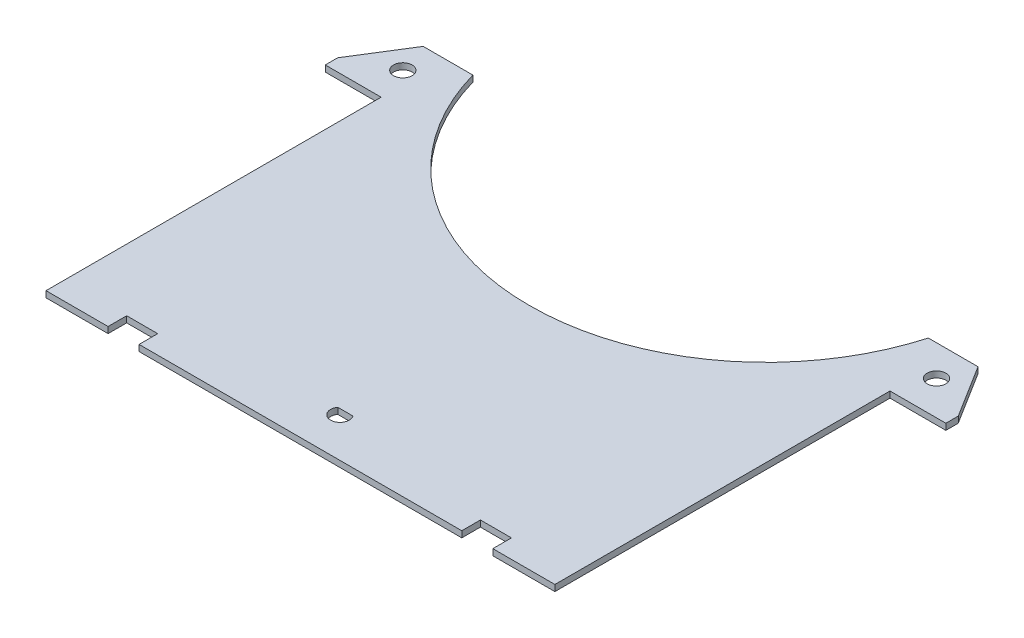
ISO-10303-21;
HEADER;
FILE_DESCRIPTION(('STEP AP214'),'2;1');
FILE_NAME('part.step','',(''),(''),'','','');
FILE_SCHEMA(('AUTOMOTIVE_DESIGN { 1 0 10303 214 1 1 1 1 }'));
ENDSEC;
DATA;
#1=APPLICATION_CONTEXT('core data for automotive mechanical design processes');
#2=APPLICATION_PROTOCOL_DEFINITION('international standard','automotive_design',2000,#1);
#3=PRODUCT_CONTEXT('',#1,'mechanical');
#4=PRODUCT('Part','Part','',(#3));
#5=PRODUCT_RELATED_PRODUCT_CATEGORY('part','',(#4));
#6=PRODUCT_DEFINITION_FORMATION('','',#4);
#7=PRODUCT_DEFINITION_CONTEXT('part definition',#1,'design');
#8=PRODUCT_DEFINITION('design','',#6,#7);
#9=PRODUCT_DEFINITION_SHAPE('','',#8);
#10=(LENGTH_UNIT() NAMED_UNIT(*) SI_UNIT(.MILLI.,.METRE.));
#11=(NAMED_UNIT(*) PLANE_ANGLE_UNIT() SI_UNIT($,.RADIAN.));
#12=(NAMED_UNIT(*) SI_UNIT($,.STERADIAN.) SOLID_ANGLE_UNIT());
#13=UNCERTAINTY_MEASURE_WITH_UNIT(LENGTH_MEASURE(1.E-05),#10,'distance_accuracy_value','');
#14=(GEOMETRIC_REPRESENTATION_CONTEXT(3) GLOBAL_UNCERTAINTY_ASSIGNED_CONTEXT((#13)) GLOBAL_UNIT_ASSIGNED_CONTEXT((#10,
#11,#12)) REPRESENTATION_CONTEXT('',''));
#15=CARTESIAN_POINT('',(0.,0.,0.));
#16=DIRECTION('',(0.,0.,1.));
#17=DIRECTION('',(1.,0.,0.));
#18=AXIS2_PLACEMENT_3D('',#15,#16,#17);
#19=CARTESIAN_POINT('',(49.8485606076485,1.,-75.0200011584743));
#20=DIRECTION('',(0.,1.,0.));
#21=DIRECTION('',(0.,0.,1.));
#22=AXIS2_PLACEMENT_3D('',#19,#20,#21);
#23=PLANE('',#22);
#24=CARTESIAN_POINT('',(7.,1.,-59.6403038160526));
#25=DIRECTION('',(0.,1.,0.));
#26=DIRECTION('',(0.,0.,1.));
#27=AXIS2_PLACEMENT_3D('',#24,#25,#26);
#28=CIRCLE('',#27,1.5);
#29=CARTESIAN_POINT('',(7.,1.,-58.1403038160526));
#30=VERTEX_POINT('',#29);
#31=EDGE_CURVE('E221',#30,#30,#28,.T.);
#32=ORIENTED_EDGE('',*,*,#31,.F.);
#33=EDGE_LOOP('',(#32));
#34=FACE_BOUND('',#33,.T.);
#35=DIRECTION('',(-1.,0.,0.));
#36=VECTOR('',#35,1.);
#37=CARTESIAN_POINT('',(5.29919264233199,1.,-64.6207847776169));
#38=LINE('',#37,#36);
#39=CARTESIAN_POINT('',(13.299192642332,1.,-64.6207847776169));
#40=VERTEX_POINT('',#39);
#41=CARTESIAN_POINT('',(5.29919264233199,1.,-64.6207847776169));
#42=VERTEX_POINT('',#41);
#43=EDGE_CURVE('E226',#40,#42,#38,.T.);
#44=ORIENTED_EDGE('',*,*,#43,.T.);
#45=DIRECTION('',(-0.5299192642332,0.,0.848048096156429));
#46=VECTOR('',#45,1.);
#47=CARTESIAN_POINT('',(0.,1.,-56.1403038160526));
#48=LINE('',#47,#46);
#49=CARTESIAN_POINT('',(0.,1.,-56.1403038160526));
#50=VERTEX_POINT('',#49);
#51=EDGE_CURVE('E230',#42,#50,#48,.T.);
#52=ORIENTED_EDGE('',*,*,#51,.T.);
#53=DIRECTION('',(0.,0.,1.));
#54=VECTOR('',#53,1.);
#55=CARTESIAN_POINT('',(0.,1.,-56.1403038160526));
#56=LINE('',#55,#54);
#57=CARTESIAN_POINT('',(0.,1.,-54.1403038160526));
#58=VERTEX_POINT('',#57);
#59=EDGE_CURVE('E234',#50,#58,#56,.T.);
#60=ORIENTED_EDGE('',*,*,#59,.T.);
#61=DIRECTION('',(1.,0.,0.));
#62=VECTOR('',#61,1.);
#63=CARTESIAN_POINT('',(0.,1.,-54.1403038160526));
#64=LINE('',#63,#62);
#65=CARTESIAN_POINT('',(9.,1.,-54.1403038160526));
#66=VERTEX_POINT('',#65);
#67=EDGE_CURVE('E237',#58,#66,#64,.T.);
#68=ORIENTED_EDGE('',*,*,#67,.T.);
#69=DIRECTION('',(0.,0.,1.));
#70=VECTOR('',#69,1.);
#71=CARTESIAN_POINT('',(9.,1.,-54.1403038160526));
#72=LINE('',#71,#70);
#73=CARTESIAN_POINT('',(8.99999999999999,1.,-0.140303816052609));
#74=VERTEX_POINT('',#73);
#75=EDGE_CURVE('E240',#66,#74,#72,.T.);
#76=ORIENTED_EDGE('',*,*,#75,.T.);
#77=DIRECTION('',(1.,0.,0.));
#78=VECTOR('',#77,1.);
#79=CARTESIAN_POINT('',(8.99999999999999,1.,-0.140303816052609));
#80=LINE('',#79,#78);
#81=CARTESIAN_POINT('',(19.,1.,-0.140303816052611));
#82=VERTEX_POINT('',#81);
#83=EDGE_CURVE('E243',#74,#82,#80,.T.);
#84=ORIENTED_EDGE('',*,*,#83,.T.);
#85=DIRECTION('',(0.,0.,-1.));
#86=VECTOR('',#85,1.);
#87=CARTESIAN_POINT('',(19.,1.,-0.140303816052611));
#88=LINE('',#87,#86);
#89=CARTESIAN_POINT('',(19.,1.,-3.14030381605261));
#90=VERTEX_POINT('',#89);
#91=EDGE_CURVE('E246',#82,#90,#88,.T.);
#92=ORIENTED_EDGE('',*,*,#91,.T.);
#93=DIRECTION('',(1.,0.,0.));
#94=VECTOR('',#93,1.);
#95=CARTESIAN_POINT('',(19.,1.,-3.14030381605261));
#96=LINE('',#95,#94);
#97=CARTESIAN_POINT('',(24.,1.,-3.14030381605261));
#98=VERTEX_POINT('',#97);
#99=EDGE_CURVE('E249',#90,#98,#96,.T.);
#100=ORIENTED_EDGE('',*,*,#99,.T.);
#101=DIRECTION('',(0.,0.,1.));
#102=VECTOR('',#101,1.);
#103=CARTESIAN_POINT('',(24.,1.,-3.14030381605261));
#104=LINE('',#103,#102);
#105=CARTESIAN_POINT('',(24.,1.,-0.140303816052612));
#106=VERTEX_POINT('',#105);
#107=EDGE_CURVE('E252',#98,#106,#104,.T.);
#108=ORIENTED_EDGE('',*,*,#107,.T.);
#109=DIRECTION('',(1.,0.,0.));
#110=VECTOR('',#109,1.);
#111=CARTESIAN_POINT('',(24.,1.,-0.140303816052612));
#112=LINE('',#111,#110);
#113=CARTESIAN_POINT('',(76.,1.,-0.140303816052626));
#114=VERTEX_POINT('',#113);
#115=EDGE_CURVE('E255',#106,#114,#112,.T.);
#116=ORIENTED_EDGE('',*,*,#115,.T.);
#117=DIRECTION('',(0.,0.,-1.));
#118=VECTOR('',#117,1.);
#119=CARTESIAN_POINT('',(76.,1.,-3.14030381605263));
#120=LINE('',#119,#118);
#121=CARTESIAN_POINT('',(76.,1.,-3.14030381605263));
#122=VERTEX_POINT('',#121);
#123=EDGE_CURVE('E258',#114,#122,#120,.T.);
#124=ORIENTED_EDGE('',*,*,#123,.T.);
#125=DIRECTION('',(1.,0.,0.));
#126=VECTOR('',#125,1.);
#127=CARTESIAN_POINT('',(81.,1.,-3.14030381605263));
#128=LINE('',#127,#126);
#129=CARTESIAN_POINT('',(81.,1.,-3.14030381605263));
#130=VERTEX_POINT('',#129);
#131=EDGE_CURVE('E261',#122,#130,#128,.T.);
#132=ORIENTED_EDGE('',*,*,#131,.T.);
#133=DIRECTION('',(0.,0.,1.));
#134=VECTOR('',#133,1.);
#135=CARTESIAN_POINT('',(81.,1.,-0.140303816052625));
#136=LINE('',#135,#134);
#137=CARTESIAN_POINT('',(81.,1.,-0.140303816052625));
#138=VERTEX_POINT('',#137);
#139=EDGE_CURVE('E264',#130,#138,#136,.T.);
#140=ORIENTED_EDGE('',*,*,#139,.T.);
#141=DIRECTION('',(1.,0.,0.));
#142=VECTOR('',#141,1.);
#143=CARTESIAN_POINT('',(91.,1.,-0.140303816052623));
#144=LINE('',#143,#142);
#145=CARTESIAN_POINT('',(91.,1.,-0.140303816052623));
#146=VERTEX_POINT('',#145);
#147=EDGE_CURVE('E267',#138,#146,#144,.T.);
#148=ORIENTED_EDGE('',*,*,#147,.T.);
#149=DIRECTION('',(0.,0.,-1.));
#150=VECTOR('',#149,1.);
#151=CARTESIAN_POINT('',(91.,1.,-54.1403038160526));
#152=LINE('',#151,#150);
#153=CARTESIAN_POINT('',(91.,1.,-54.1403038160526));
#154=VERTEX_POINT('',#153);
#155=EDGE_CURVE('E270',#146,#154,#152,.T.);
#156=ORIENTED_EDGE('',*,*,#155,.T.);
#157=DIRECTION('',(1.,0.,0.));
#158=VECTOR('',#157,1.);
#159=CARTESIAN_POINT('',(100.,1.,-54.1403038160526));
#160=LINE('',#159,#158);
#161=CARTESIAN_POINT('',(100.,1.,-54.1403038160526));
#162=VERTEX_POINT('',#161);
#163=EDGE_CURVE('E273',#154,#162,#160,.T.);
#164=ORIENTED_EDGE('',*,*,#163,.T.);
#165=DIRECTION('',(0.,0.,-1.));
#166=VECTOR('',#165,1.);
#167=CARTESIAN_POINT('',(99.9999999999999,1.,-56.1403038160526));
#168=LINE('',#167,#166);
#169=CARTESIAN_POINT('',(99.9999999999999,1.,-56.1403038160526));
#170=VERTEX_POINT('',#169);
#171=EDGE_CURVE('E276',#162,#170,#168,.T.);
#172=ORIENTED_EDGE('',*,*,#171,.T.);
#173=DIRECTION('',(-0.5299192642332,0.,-0.848048096156429));
#174=VECTOR('',#173,1.);
#175=CARTESIAN_POINT('',(99.9999999999999,1.,-56.1403038160526));
#176=LINE('',#175,#174);
#177=CARTESIAN_POINT('',(94.700807357668,1.,-64.6207847776169));
#178=VERTEX_POINT('',#177);
#179=EDGE_CURVE('E279',#170,#178,#176,.T.);
#180=ORIENTED_EDGE('',*,*,#179,.T.);
#181=DIRECTION('',(-1.,0.,0.));
#182=VECTOR('',#181,1.);
#183=CARTESIAN_POINT('',(94.700807357668,1.,-64.6207847776169));
#184=LINE('',#183,#182);
#185=CARTESIAN_POINT('',(86.7008073576679,1.,-64.6207847776169));
#186=VERTEX_POINT('',#185);
#187=EDGE_CURVE('E282',#178,#186,#184,.T.);
#188=ORIENTED_EDGE('',*,*,#187,.T.);
#189=CARTESIAN_POINT('',(50.1514393923514,1.,-75.0200011584743));
#190=DIRECTION('',(0.,-1.,0.));
#191=DIRECTION('',(0.,0.,-1.));
#192=AXIS2_PLACEMENT_3D('',#189,#190,#191);
#193=CIRCLE('',#192,38.);
#194=CARTESIAN_POINT('',(50.,1.,-37.0203029213772));
#195=VERTEX_POINT('',#194);
#196=EDGE_CURVE('E285',#186,#195,#193,.T.);
#197=ORIENTED_EDGE('',*,*,#196,.T.);
#198=CARTESIAN_POINT('',(49.8485606076485,1.,-75.0200011584743));
#199=DIRECTION('',(0.,-1.,0.));
#200=DIRECTION('',(0.,0.,1.));
#201=AXIS2_PLACEMENT_3D('',#198,#199,#200);
#202=CIRCLE('',#201,38.);
#203=EDGE_CURVE('E288',#195,#40,#202,.T.);
#204=ORIENTED_EDGE('',*,*,#203,.T.);
#205=EDGE_LOOP('',(#44,#52,#60,#68,#76,#84,#92,#100,#108,#116,#124,#132,#140,#148,#156,#164,
#172,#180,#188,#197,#204));
#206=FACE_BOUND('',#205,.T.);
#207=DIRECTION('',(-1.,0.,0.));
#208=VECTOR('',#207,1.);
#209=CARTESIAN_POINT('',(48.7816507068989,1.,-7.375));
#210=LINE('',#209,#208);
#211=CARTESIAN_POINT('',(51.2183492931011,1.,-7.37499999999999));
#212=VERTEX_POINT('',#211);
#213=CARTESIAN_POINT('',(48.7816507068989,1.,-7.375));
#214=VERTEX_POINT('',#213);
#215=EDGE_CURVE('E198',#212,#214,#210,.T.);
#216=ORIENTED_EDGE('',*,*,#215,.F.);
#217=CARTESIAN_POINT('',(50.,1.,-6.5));
#218=DIRECTION('',(0.,1.,0.));
#219=DIRECTION('',(0.,0.,1.));
#220=AXIS2_PLACEMENT_3D('',#217,#218,#219);
#221=CIRCLE('',#220,1.50000000000001);
#222=EDGE_CURVE('E205',#214,#212,#221,.T.);
#223=ORIENTED_EDGE('',*,*,#222,.F.);
#224=EDGE_LOOP('',(#216,#223));
#225=FACE_BOUND('',#224,.T.);
#226=CARTESIAN_POINT('',(92.9999999999999,1.,-59.6403038160526));
#227=DIRECTION('',(0.,1.,0.));
#228=DIRECTION('',(0.,0.,-1.));
#229=AXIS2_PLACEMENT_3D('',#226,#227,#228);
#230=CIRCLE('',#229,1.5);
#231=CARTESIAN_POINT('',(92.9999999999999,1.,-61.1403038160526));
#232=VERTEX_POINT('',#231);
#233=EDGE_CURVE('E813',#232,#232,#230,.T.);
#234=ORIENTED_EDGE('',*,*,#233,.F.);
#235=EDGE_LOOP('',(#234));
#236=FACE_BOUND('',#235,.T.);
#237=ADVANCED_FACE('F43',(#34,#206,#225,#236),#23,.T.);
#238=CARTESIAN_POINT('',(49.8485606076485,0.,-75.0200011584743));
#239=DIRECTION('',(0.,1.,0.));
#240=DIRECTION('',(0.,0.,1.));
#241=AXIS2_PLACEMENT_3D('',#238,#239,#240);
#242=PLANE('',#241);
#243=DIRECTION('',(-1.,0.,0.));
#244=VECTOR('',#243,1.);
#245=CARTESIAN_POINT('',(5.29919264233199,0.,-64.6207847776169));
#246=LINE('',#245,#244);
#247=CARTESIAN_POINT('',(13.299192642332,0.,-64.6207847776169));
#248=VERTEX_POINT('',#247);
#249=CARTESIAN_POINT('',(5.29919264233199,0.,-64.6207847776169));
#250=VERTEX_POINT('',#249);
#251=EDGE_CURVE('E225',#248,#250,#246,.T.);
#252=ORIENTED_EDGE('',*,*,#251,.F.);
#253=CARTESIAN_POINT('',(49.8485606076485,0.,-75.0200011584743));
#254=DIRECTION('',(0.,-1.,0.));
#255=DIRECTION('',(0.,0.,1.));
#256=AXIS2_PLACEMENT_3D('',#253,#254,#255);
#257=CIRCLE('',#256,38.);
#258=CARTESIAN_POINT('',(50.,0.,-37.0203029213772));
#259=VERTEX_POINT('',#258);
#260=EDGE_CURVE('E231',#259,#248,#257,.T.);
#261=ORIENTED_EDGE('',*,*,#260,.F.);
#262=CARTESIAN_POINT('',(50.1514393923514,0.,-75.0200011584743));
#263=DIRECTION('',(0.,-1.,0.));
#264=DIRECTION('',(0.,0.,-1.));
#265=AXIS2_PLACEMENT_3D('',#262,#263,#264);
#266=CIRCLE('',#265,38.);
#267=CARTESIAN_POINT('',(86.7008073576679,0.,-64.6207847776169));
#268=VERTEX_POINT('',#267);
#269=EDGE_CURVE('E349',#268,#259,#266,.T.);
#270=ORIENTED_EDGE('',*,*,#269,.F.);
#271=DIRECTION('',(-1.,0.,0.));
#272=VECTOR('',#271,1.);
#273=CARTESIAN_POINT('',(94.700807357668,0.,-64.6207847776169));
#274=LINE('',#273,#272);
#275=CARTESIAN_POINT('',(94.700807357668,0.,-64.6207847776169));
#276=VERTEX_POINT('',#275);
#277=EDGE_CURVE('E346',#276,#268,#274,.T.);
#278=ORIENTED_EDGE('',*,*,#277,.F.);
#279=DIRECTION('',(-0.5299192642332,0.,-0.848048096156429));
#280=VECTOR('',#279,1.);
#281=CARTESIAN_POINT('',(99.9999999999999,0.,-56.1403038160526));
#282=LINE('',#281,#280);
#283=CARTESIAN_POINT('',(99.9999999999999,0.,-56.1403038160526));
#284=VERTEX_POINT('',#283);
#285=EDGE_CURVE('E343',#284,#276,#282,.T.);
#286=ORIENTED_EDGE('',*,*,#285,.F.);
#287=DIRECTION('',(0.,0.,-1.));
#288=VECTOR('',#287,1.);
#289=CARTESIAN_POINT('',(99.9999999999999,0.,-56.1403038160526));
#290=LINE('',#289,#288);
#291=CARTESIAN_POINT('',(100.,0.,-54.1403038160526));
#292=VERTEX_POINT('',#291);
#293=EDGE_CURVE('E340',#292,#284,#290,.T.);
#294=ORIENTED_EDGE('',*,*,#293,.F.);
#295=DIRECTION('',(1.,0.,0.));
#296=VECTOR('',#295,1.);
#297=CARTESIAN_POINT('',(100.,0.,-54.1403038160526));
#298=LINE('',#297,#296);
#299=CARTESIAN_POINT('',(91.,0.,-54.1403038160526));
#300=VERTEX_POINT('',#299);
#301=EDGE_CURVE('E337',#300,#292,#298,.T.);
#302=ORIENTED_EDGE('',*,*,#301,.F.);
#303=DIRECTION('',(0.,0.,-1.));
#304=VECTOR('',#303,1.);
#305=CARTESIAN_POINT('',(91.,0.,-54.1403038160526));
#306=LINE('',#305,#304);
#307=CARTESIAN_POINT('',(91.,0.,-0.140303816052623));
#308=VERTEX_POINT('',#307);
#309=EDGE_CURVE('E334',#308,#300,#306,.T.);
#310=ORIENTED_EDGE('',*,*,#309,.F.);
#311=DIRECTION('',(1.,0.,0.));
#312=VECTOR('',#311,1.);
#313=CARTESIAN_POINT('',(91.,0.,-0.140303816052623));
#314=LINE('',#313,#312);
#315=CARTESIAN_POINT('',(81.,0.,-0.140303816052625));
#316=VERTEX_POINT('',#315);
#317=EDGE_CURVE('E331',#316,#308,#314,.T.);
#318=ORIENTED_EDGE('',*,*,#317,.F.);
#319=DIRECTION('',(0.,0.,1.));
#320=VECTOR('',#319,1.);
#321=CARTESIAN_POINT('',(81.,0.,-0.140303816052625));
#322=LINE('',#321,#320);
#323=CARTESIAN_POINT('',(81.,0.,-3.14030381605263));
#324=VERTEX_POINT('',#323);
#325=EDGE_CURVE('E328',#324,#316,#322,.T.);
#326=ORIENTED_EDGE('',*,*,#325,.F.);
#327=DIRECTION('',(1.,0.,0.));
#328=VECTOR('',#327,1.);
#329=CARTESIAN_POINT('',(81.,0.,-3.14030381605263));
#330=LINE('',#329,#328);
#331=CARTESIAN_POINT('',(76.,0.,-3.14030381605263));
#332=VERTEX_POINT('',#331);
#333=EDGE_CURVE('E325',#332,#324,#330,.T.);
#334=ORIENTED_EDGE('',*,*,#333,.F.);
#335=DIRECTION('',(0.,0.,-1.));
#336=VECTOR('',#335,1.);
#337=CARTESIAN_POINT('',(76.,0.,-3.14030381605263));
#338=LINE('',#337,#336);
#339=CARTESIAN_POINT('',(76.,0.,-0.140303816052626));
#340=VERTEX_POINT('',#339);
#341=EDGE_CURVE('E322',#340,#332,#338,.T.);
#342=ORIENTED_EDGE('',*,*,#341,.F.);
#343=DIRECTION('',(1.,0.,0.));
#344=VECTOR('',#343,1.);
#345=CARTESIAN_POINT('',(24.,0.,-0.140303816052612));
#346=LINE('',#345,#344);
#347=CARTESIAN_POINT('',(24.,0.,-0.140303816052612));
#348=VERTEX_POINT('',#347);
#349=EDGE_CURVE('E319',#348,#340,#346,.T.);
#350=ORIENTED_EDGE('',*,*,#349,.F.);
#351=DIRECTION('',(0.,0.,1.));
#352=VECTOR('',#351,1.);
#353=CARTESIAN_POINT('',(24.,0.,-3.14030381605261));
#354=LINE('',#353,#352);
#355=CARTESIAN_POINT('',(24.,0.,-3.14030381605261));
#356=VERTEX_POINT('',#355);
#357=EDGE_CURVE('E316',#356,#348,#354,.T.);
#358=ORIENTED_EDGE('',*,*,#357,.F.);
#359=DIRECTION('',(1.,0.,0.));
#360=VECTOR('',#359,1.);
#361=CARTESIAN_POINT('',(19.,0.,-3.14030381605261));
#362=LINE('',#361,#360);
#363=CARTESIAN_POINT('',(19.,0.,-3.14030381605261));
#364=VERTEX_POINT('',#363);
#365=EDGE_CURVE('E313',#364,#356,#362,.T.);
#366=ORIENTED_EDGE('',*,*,#365,.F.);
#367=DIRECTION('',(0.,0.,-1.));
#368=VECTOR('',#367,1.);
#369=CARTESIAN_POINT('',(19.,0.,-0.140303816052611));
#370=LINE('',#369,#368);
#371=CARTESIAN_POINT('',(19.,0.,-0.140303816052611));
#372=VERTEX_POINT('',#371);
#373=EDGE_CURVE('E310',#372,#364,#370,.T.);
#374=ORIENTED_EDGE('',*,*,#373,.F.);
#375=DIRECTION('',(1.,0.,0.));
#376=VECTOR('',#375,1.);
#377=CARTESIAN_POINT('',(8.99999999999999,0.,-0.140303816052609));
#378=LINE('',#377,#376);
#379=CARTESIAN_POINT('',(8.99999999999999,0.,-0.140303816052609));
#380=VERTEX_POINT('',#379);
#381=EDGE_CURVE('E307',#380,#372,#378,.T.);
#382=ORIENTED_EDGE('',*,*,#381,.F.);
#383=DIRECTION('',(0.,0.,1.));
#384=VECTOR('',#383,1.);
#385=CARTESIAN_POINT('',(9.,0.,-54.1403038160526));
#386=LINE('',#385,#384);
#387=CARTESIAN_POINT('',(9.,0.,-54.1403038160526));
#388=VERTEX_POINT('',#387);
#389=EDGE_CURVE('E304',#388,#380,#386,.T.);
#390=ORIENTED_EDGE('',*,*,#389,.F.);
#391=DIRECTION('',(1.,0.,0.));
#392=VECTOR('',#391,1.);
#393=CARTESIAN_POINT('',(0.,0.,-54.1403038160526));
#394=LINE('',#393,#392);
#395=CARTESIAN_POINT('',(0.,0.,-54.1403038160526));
#396=VERTEX_POINT('',#395);
#397=EDGE_CURVE('E301',#396,#388,#394,.T.);
#398=ORIENTED_EDGE('',*,*,#397,.F.);
#399=DIRECTION('',(0.,0.,1.));
#400=VECTOR('',#399,1.);
#401=CARTESIAN_POINT('',(0.,0.,-56.1403038160526));
#402=LINE('',#401,#400);
#403=CARTESIAN_POINT('',(0.,0.,-56.1403038160526));
#404=VERTEX_POINT('',#403);
#405=EDGE_CURVE('E298',#404,#396,#402,.T.);
#406=ORIENTED_EDGE('',*,*,#405,.F.);
#407=DIRECTION('',(-0.5299192642332,0.,0.848048096156429));
#408=VECTOR('',#407,1.);
#409=CARTESIAN_POINT('',(0.,0.,-56.1403038160526));
#410=LINE('',#409,#408);
#411=EDGE_CURVE('E295',#250,#404,#410,.T.);
#412=ORIENTED_EDGE('',*,*,#411,.F.);
#413=EDGE_LOOP('',(#252,#261,#270,#278,#286,#294,#302,#310,#318,#326,#334,#342,#350,#358,#366,
#374,#382,#390,#398,#406,#412));
#414=FACE_BOUND('',#413,.T.);
#415=CARTESIAN_POINT('',(50.,0.,-6.5));
#416=DIRECTION('',(0.,1.,0.));
#417=DIRECTION('',(0.,0.,1.));
#418=AXIS2_PLACEMENT_3D('',#415,#416,#417);
#419=CIRCLE('',#418,1.50000000000001);
#420=CARTESIAN_POINT('',(48.7816507068989,0.,-7.37499999999999));
#421=VERTEX_POINT('',#420);
#422=CARTESIAN_POINT('',(51.2183492931011,0.,-7.375));
#423=VERTEX_POINT('',#422);
#424=EDGE_CURVE('E66',#421,#423,#419,.T.);
#425=ORIENTED_EDGE('',*,*,#424,.T.);
#426=DIRECTION('',(-1.,0.,0.));
#427=VECTOR('',#426,1.);
#428=CARTESIAN_POINT('',(48.7816507068989,0.,-7.375));
#429=LINE('',#428,#427);
#430=EDGE_CURVE('E212',#423,#421,#429,.T.);
#431=ORIENTED_EDGE('',*,*,#430,.T.);
#432=EDGE_LOOP('',(#425,#431));
#433=FACE_BOUND('',#432,.T.);
#434=CARTESIAN_POINT('',(7.,0.,-59.6403038160526));
#435=DIRECTION('',(0.,1.,0.));
#436=DIRECTION('',(0.,0.,1.));
#437=AXIS2_PLACEMENT_3D('',#434,#435,#436);
#438=CIRCLE('',#437,1.5);
#439=CARTESIAN_POINT('',(7.,0.,-58.1403038160526));
#440=VERTEX_POINT('',#439);
#441=EDGE_CURVE('E217',#440,#440,#438,.T.);
#442=ORIENTED_EDGE('',*,*,#441,.T.);
#443=EDGE_LOOP('',(#442));
#444=FACE_BOUND('',#443,.T.);
#445=CARTESIAN_POINT('',(92.9999999999999,0.,-59.6403038160526));
#446=DIRECTION('',(0.,1.,0.));
#447=DIRECTION('',(0.,0.,-1.));
#448=AXIS2_PLACEMENT_3D('',#445,#446,#447);
#449=CIRCLE('',#448,1.5);
#450=CARTESIAN_POINT('',(92.9999999999999,0.,-61.1403038160526));
#451=VERTEX_POINT('',#450);
#452=EDGE_CURVE('E816',#451,#451,#449,.T.);
#453=ORIENTED_EDGE('',*,*,#452,.T.);
#454=EDGE_LOOP('',(#453));
#455=FACE_BOUND('',#454,.T.);
#456=ADVANCED_FACE('F440',(#414,#433,#444,#455),#242,.F.);
#457=CARTESIAN_POINT('',(5.29919264233199,1.,-64.6207847776169));
#458=DIRECTION('',(0.,0.,1.));
#459=DIRECTION('',(1.,0.,0.));
#460=AXIS2_PLACEMENT_3D('',#457,#458,#459);
#461=PLANE('',#460);
#462=ORIENTED_EDGE('',*,*,#251,.T.);
#463=DIRECTION('',(0.,-1.,0.));
#464=VECTOR('',#463,1.);
#465=CARTESIAN_POINT('',(5.29919264233199,1.,-64.6207847776169));
#466=LINE('',#465,#464);
#467=EDGE_CURVE('E11',#42,#250,#466,.T.);
#468=ORIENTED_EDGE('',*,*,#467,.F.);
#469=ORIENTED_EDGE('',*,*,#43,.F.);
#470=DIRECTION('',(0.,-1.,0.));
#471=VECTOR('',#470,1.);
#472=CARTESIAN_POINT('',(13.299192642332,1.,-64.6207847776169));
#473=LINE('',#472,#471);
#474=EDGE_CURVE('E291',#40,#248,#473,.T.);
#475=ORIENTED_EDGE('',*,*,#474,.T.);
#476=EDGE_LOOP('',(#462,#468,#469,#475));
#477=FACE_BOUND('',#476,.T.);
#478=ADVANCED_FACE('F45',(#477),#461,.F.);
#479=CARTESIAN_POINT('',(0.,1.,-56.1403038160526));
#480=DIRECTION('',(0.848048096156429,0.,0.5299192642332));
#481=DIRECTION('',(0.5299192642332,0.,-0.848048096156429));
#482=AXIS2_PLACEMENT_3D('',#479,#480,#481);
#483=PLANE('',#482);
#484=ORIENTED_EDGE('',*,*,#411,.T.);
#485=DIRECTION('',(0.,-1.,0.));
#486=VECTOR('',#485,1.);
#487=CARTESIAN_POINT('',(0.,1.,-56.1403038160526));
#488=LINE('',#487,#486);
#489=EDGE_CURVE('E52',#50,#404,#488,.T.);
#490=ORIENTED_EDGE('',*,*,#489,.F.);
#491=ORIENTED_EDGE('',*,*,#51,.F.);
#492=ORIENTED_EDGE('',*,*,#467,.T.);
#493=EDGE_LOOP('',(#484,#490,#491,#492));
#494=FACE_BOUND('',#493,.T.);
#495=ADVANCED_FACE('F457',(#494),#483,.F.);
#496=CARTESIAN_POINT('',(0.,1.,-56.1403038160526));
#497=DIRECTION('',(1.,0.,0.));
#498=DIRECTION('',(0.,0.,-1.));
#499=AXIS2_PLACEMENT_3D('',#496,#497,#498);
#500=PLANE('',#499);
#501=ORIENTED_EDGE('',*,*,#405,.T.);
#502=DIRECTION('',(0.,-1.,0.));
#503=VECTOR('',#502,1.);
#504=CARTESIAN_POINT('',(0.,1.,-54.1403038160526));
#505=LINE('',#504,#503);
#506=EDGE_CURVE('E425',#58,#396,#505,.T.);
#507=ORIENTED_EDGE('',*,*,#506,.F.);
#508=ORIENTED_EDGE('',*,*,#59,.F.);
#509=ORIENTED_EDGE('',*,*,#489,.T.);
#510=EDGE_LOOP('',(#501,#507,#508,#509));
#511=FACE_BOUND('',#510,.T.);
#512=ADVANCED_FACE('F434',(#511),#500,.F.);
#513=CARTESIAN_POINT('',(0.,1.,-54.1403038160526));
#514=DIRECTION('',(0.,0.,-1.));
#515=DIRECTION('',(-1.,0.,0.));
#516=AXIS2_PLACEMENT_3D('',#513,#514,#515);
#517=PLANE('',#516);
#518=ORIENTED_EDGE('',*,*,#397,.T.);
#519=DIRECTION('',(0.,-1.,0.));
#520=VECTOR('',#519,1.);
#521=CARTESIAN_POINT('',(9.,1.,-54.1403038160526));
#522=LINE('',#521,#520);
#523=EDGE_CURVE('E421',#66,#388,#522,.T.);
#524=ORIENTED_EDGE('',*,*,#523,.F.);
#525=ORIENTED_EDGE('',*,*,#67,.F.);
#526=ORIENTED_EDGE('',*,*,#506,.T.);
#527=EDGE_LOOP('',(#518,#524,#525,#526));
#528=FACE_BOUND('',#527,.T.);
#529=ADVANCED_FACE('F446',(#528),#517,.F.);
#530=CARTESIAN_POINT('',(9.,1.,-54.1403038160526));
#531=DIRECTION('',(1.,0.,0.));
#532=DIRECTION('',(0.,0.,-1.));
#533=AXIS2_PLACEMENT_3D('',#530,#531,#532);
#534=PLANE('',#533);
#535=ORIENTED_EDGE('',*,*,#389,.T.);
#536=DIRECTION('',(0.,-1.,0.));
#537=VECTOR('',#536,1.);
#538=CARTESIAN_POINT('',(8.99999999999999,1.,-0.140303816052609));
#539=LINE('',#538,#537);
#540=EDGE_CURVE('E417',#74,#380,#539,.T.);
#541=ORIENTED_EDGE('',*,*,#540,.F.);
#542=ORIENTED_EDGE('',*,*,#75,.F.);
#543=ORIENTED_EDGE('',*,*,#523,.T.);
#544=EDGE_LOOP('',(#535,#541,#542,#543));
#545=FACE_BOUND('',#544,.T.);
#546=ADVANCED_FACE('F450',(#545),#534,.F.);
#547=CARTESIAN_POINT('',(8.99999999999999,1.,-0.140303816052609));
#548=DIRECTION('',(0.,0.,-1.));
#549=DIRECTION('',(-1.,0.,0.));
#550=AXIS2_PLACEMENT_3D('',#547,#548,#549);
#551=PLANE('',#550);
#552=ORIENTED_EDGE('',*,*,#381,.T.);
#553=DIRECTION('',(0.,-1.,0.));
#554=VECTOR('',#553,1.);
#555=CARTESIAN_POINT('',(19.,1.,-0.140303816052611));
#556=LINE('',#555,#554);
#557=EDGE_CURVE('E413',#82,#372,#556,.T.);
#558=ORIENTED_EDGE('',*,*,#557,.F.);
#559=ORIENTED_EDGE('',*,*,#83,.F.);
#560=ORIENTED_EDGE('',*,*,#540,.T.);
#561=EDGE_LOOP('',(#552,#558,#559,#560));
#562=FACE_BOUND('',#561,.T.);
#563=ADVANCED_FACE('F535',(#562),#551,.F.);
#564=CARTESIAN_POINT('',(19.,1.,-0.140303816052611));
#565=DIRECTION('',(-1.,0.,0.));
#566=DIRECTION('',(0.,0.,1.));
#567=AXIS2_PLACEMENT_3D('',#564,#565,#566);
#568=PLANE('',#567);
#569=ORIENTED_EDGE('',*,*,#373,.T.);
#570=DIRECTION('',(0.,-1.,0.));
#571=VECTOR('',#570,1.);
#572=CARTESIAN_POINT('',(19.,1.,-3.14030381605261));
#573=LINE('',#572,#571);
#574=EDGE_CURVE('E409',#90,#364,#573,.T.);
#575=ORIENTED_EDGE('',*,*,#574,.F.);
#576=ORIENTED_EDGE('',*,*,#91,.F.);
#577=ORIENTED_EDGE('',*,*,#557,.T.);
#578=EDGE_LOOP('',(#569,#575,#576,#577));
#579=FACE_BOUND('',#578,.T.);
#580=ADVANCED_FACE('F533',(#579),#568,.F.);
#581=CARTESIAN_POINT('',(19.,1.,-3.14030381605261));
#582=DIRECTION('',(0.,0.,-1.));
#583=DIRECTION('',(-1.,0.,0.));
#584=AXIS2_PLACEMENT_3D('',#581,#582,#583);
#585=PLANE('',#584);
#586=ORIENTED_EDGE('',*,*,#365,.T.);
#587=DIRECTION('',(0.,-1.,0.));
#588=VECTOR('',#587,1.);
#589=CARTESIAN_POINT('',(24.,1.,-3.14030381605261));
#590=LINE('',#589,#588);
#591=EDGE_CURVE('E405',#98,#356,#590,.T.);
#592=ORIENTED_EDGE('',*,*,#591,.F.);
#593=ORIENTED_EDGE('',*,*,#99,.F.);
#594=ORIENTED_EDGE('',*,*,#574,.T.);
#595=EDGE_LOOP('',(#586,#592,#593,#594));
#596=FACE_BOUND('',#595,.T.);
#597=ADVANCED_FACE('F529',(#596),#585,.F.);
#598=CARTESIAN_POINT('',(24.,1.,-3.14030381605261));
#599=DIRECTION('',(1.,0.,0.));
#600=DIRECTION('',(0.,0.,-1.));
#601=AXIS2_PLACEMENT_3D('',#598,#599,#600);
#602=PLANE('',#601);
#603=ORIENTED_EDGE('',*,*,#357,.T.);
#604=DIRECTION('',(0.,-1.,0.));
#605=VECTOR('',#604,1.);
#606=CARTESIAN_POINT('',(24.,1.,-0.140303816052612));
#607=LINE('',#606,#605);
#608=EDGE_CURVE('E401',#106,#348,#607,.T.);
#609=ORIENTED_EDGE('',*,*,#608,.F.);
#610=ORIENTED_EDGE('',*,*,#107,.F.);
#611=ORIENTED_EDGE('',*,*,#591,.T.);
#612=EDGE_LOOP('',(#603,#609,#610,#611));
#613=FACE_BOUND('',#612,.T.);
#614=ADVANCED_FACE('F524',(#613),#602,.F.);
#615=CARTESIAN_POINT('',(24.,1.,-0.140303816052612));
#616=DIRECTION('',(0.,0.,-1.));
#617=DIRECTION('',(-1.,0.,0.));
#618=AXIS2_PLACEMENT_3D('',#615,#616,#617);
#619=PLANE('',#618);
#620=ORIENTED_EDGE('',*,*,#349,.T.);
#621=DIRECTION('',(0.,-1.,0.));
#622=VECTOR('',#621,1.);
#623=CARTESIAN_POINT('',(76.,1.,-0.140303816052626));
#624=LINE('',#623,#622);
#625=EDGE_CURVE('E397',#114,#340,#624,.T.);
#626=ORIENTED_EDGE('',*,*,#625,.F.);
#627=ORIENTED_EDGE('',*,*,#115,.F.);
#628=ORIENTED_EDGE('',*,*,#608,.T.);
#629=EDGE_LOOP('',(#620,#626,#627,#628));
#630=FACE_BOUND('',#629,.T.);
#631=ADVANCED_FACE('F518',(#630),#619,.F.);
#632=CARTESIAN_POINT('',(76.,1.,-3.14030381605263));
#633=DIRECTION('',(-1.,0.,0.));
#634=DIRECTION('',(0.,0.,1.));
#635=AXIS2_PLACEMENT_3D('',#632,#633,#634);
#636=PLANE('',#635);
#637=ORIENTED_EDGE('',*,*,#341,.T.);
#638=DIRECTION('',(0.,-1.,0.));
#639=VECTOR('',#638,1.);
#640=CARTESIAN_POINT('',(76.,1.,-3.14030381605263));
#641=LINE('',#640,#639);
#642=EDGE_CURVE('E393',#122,#332,#641,.T.);
#643=ORIENTED_EDGE('',*,*,#642,.F.);
#644=ORIENTED_EDGE('',*,*,#123,.F.);
#645=ORIENTED_EDGE('',*,*,#625,.T.);
#646=EDGE_LOOP('',(#637,#643,#644,#645));
#647=FACE_BOUND('',#646,.T.);
#648=ADVANCED_FACE('F514',(#647),#636,.F.);
#649=CARTESIAN_POINT('',(81.,1.,-3.14030381605263));
#650=DIRECTION('',(0.,0.,-1.));
#651=DIRECTION('',(-1.,0.,0.));
#652=AXIS2_PLACEMENT_3D('',#649,#650,#651);
#653=PLANE('',#652);
#654=ORIENTED_EDGE('',*,*,#333,.T.);
#655=DIRECTION('',(0.,-1.,0.));
#656=VECTOR('',#655,1.);
#657=CARTESIAN_POINT('',(81.,1.,-3.14030381605263));
#658=LINE('',#657,#656);
#659=EDGE_CURVE('E389',#130,#324,#658,.T.);
#660=ORIENTED_EDGE('',*,*,#659,.F.);
#661=ORIENTED_EDGE('',*,*,#131,.F.);
#662=ORIENTED_EDGE('',*,*,#642,.T.);
#663=EDGE_LOOP('',(#654,#660,#661,#662));
#664=FACE_BOUND('',#663,.T.);
#665=ADVANCED_FACE('F509',(#664),#653,.F.);
#666=CARTESIAN_POINT('',(81.,1.,-0.140303816052625));
#667=DIRECTION('',(1.,0.,0.));
#668=DIRECTION('',(0.,0.,-1.));
#669=AXIS2_PLACEMENT_3D('',#666,#667,#668);
#670=PLANE('',#669);
#671=ORIENTED_EDGE('',*,*,#325,.T.);
#672=DIRECTION('',(0.,-1.,0.));
#673=VECTOR('',#672,1.);
#674=CARTESIAN_POINT('',(81.,1.,-0.140303816052625));
#675=LINE('',#674,#673);
#676=EDGE_CURVE('E385',#138,#316,#675,.T.);
#677=ORIENTED_EDGE('',*,*,#676,.F.);
#678=ORIENTED_EDGE('',*,*,#139,.F.);
#679=ORIENTED_EDGE('',*,*,#659,.T.);
#680=EDGE_LOOP('',(#671,#677,#678,#679));
#681=FACE_BOUND('',#680,.T.);
#682=ADVANCED_FACE('F503',(#681),#670,.F.);
#683=CARTESIAN_POINT('',(91.,1.,-0.140303816052623));
#684=DIRECTION('',(0.,0.,-1.));
#685=DIRECTION('',(-1.,0.,0.));
#686=AXIS2_PLACEMENT_3D('',#683,#684,#685);
#687=PLANE('',#686);
#688=ORIENTED_EDGE('',*,*,#317,.T.);
#689=DIRECTION('',(0.,-1.,0.));
#690=VECTOR('',#689,1.);
#691=CARTESIAN_POINT('',(91.,1.,-0.140303816052623));
#692=LINE('',#691,#690);
#693=EDGE_CURVE('E381',#146,#308,#692,.T.);
#694=ORIENTED_EDGE('',*,*,#693,.F.);
#695=ORIENTED_EDGE('',*,*,#147,.F.);
#696=ORIENTED_EDGE('',*,*,#676,.T.);
#697=EDGE_LOOP('',(#688,#694,#695,#696));
#698=FACE_BOUND('',#697,.T.);
#699=ADVANCED_FACE('F499',(#698),#687,.F.);
#700=CARTESIAN_POINT('',(91.,1.,-54.1403038160526));
#701=DIRECTION('',(-1.,0.,0.));
#702=DIRECTION('',(0.,0.,1.));
#703=AXIS2_PLACEMENT_3D('',#700,#701,#702);
#704=PLANE('',#703);
#705=ORIENTED_EDGE('',*,*,#309,.T.);
#706=DIRECTION('',(0.,-1.,0.));
#707=VECTOR('',#706,1.);
#708=CARTESIAN_POINT('',(91.,1.,-54.1403038160526));
#709=LINE('',#708,#707);
#710=EDGE_CURVE('E377',#154,#300,#709,.T.);
#711=ORIENTED_EDGE('',*,*,#710,.F.);
#712=ORIENTED_EDGE('',*,*,#155,.F.);
#713=ORIENTED_EDGE('',*,*,#693,.T.);
#714=EDGE_LOOP('',(#705,#711,#712,#713));
#715=FACE_BOUND('',#714,.T.);
#716=ADVANCED_FACE('F494',(#715),#704,.F.);
#717=CARTESIAN_POINT('',(100.,1.,-54.1403038160526));
#718=DIRECTION('',(0.,0.,-1.));
#719=DIRECTION('',(-1.,0.,0.));
#720=AXIS2_PLACEMENT_3D('',#717,#718,#719);
#721=PLANE('',#720);
#722=ORIENTED_EDGE('',*,*,#301,.T.);
#723=DIRECTION('',(0.,-1.,0.));
#724=VECTOR('',#723,1.);
#725=CARTESIAN_POINT('',(100.,1.,-54.1403038160526));
#726=LINE('',#725,#724);
#727=EDGE_CURVE('E373',#162,#292,#726,.T.);
#728=ORIENTED_EDGE('',*,*,#727,.F.);
#729=ORIENTED_EDGE('',*,*,#163,.F.);
#730=ORIENTED_EDGE('',*,*,#710,.T.);
#731=EDGE_LOOP('',(#722,#728,#729,#730));
#732=FACE_BOUND('',#731,.T.);
#733=ADVANCED_FACE('F488',(#732),#721,.F.);
#734=CARTESIAN_POINT('',(99.9999999999999,1.,-56.1403038160526));
#735=DIRECTION('',(-1.,0.,0.));
#736=DIRECTION('',(0.,0.,1.));
#737=AXIS2_PLACEMENT_3D('',#734,#735,#736);
#738=PLANE('',#737);
#739=ORIENTED_EDGE('',*,*,#293,.T.);
#740=DIRECTION('',(0.,-1.,0.));
#741=VECTOR('',#740,1.);
#742=CARTESIAN_POINT('',(99.9999999999999,1.,-56.1403038160526));
#743=LINE('',#742,#741);
#744=EDGE_CURVE('E369',#170,#284,#743,.T.);
#745=ORIENTED_EDGE('',*,*,#744,.F.);
#746=ORIENTED_EDGE('',*,*,#171,.F.);
#747=ORIENTED_EDGE('',*,*,#727,.T.);
#748=EDGE_LOOP('',(#739,#745,#746,#747));
#749=FACE_BOUND('',#748,.T.);
#750=ADVANCED_FACE('F484',(#749),#738,.F.);
#751=CARTESIAN_POINT('',(99.9999999999999,1.,-56.1403038160526));
#752=DIRECTION('',(-0.848048096156429,0.,0.5299192642332));
#753=DIRECTION('',(0.5299192642332,0.,0.848048096156429));
#754=AXIS2_PLACEMENT_3D('',#751,#752,#753);
#755=PLANE('',#754);
#756=ORIENTED_EDGE('',*,*,#285,.T.);
#757=DIRECTION('',(0.,-1.,0.));
#758=VECTOR('',#757,1.);
#759=CARTESIAN_POINT('',(94.700807357668,1.,-64.6207847776169));
#760=LINE('',#759,#758);
#761=EDGE_CURVE('E365',#178,#276,#760,.T.);
#762=ORIENTED_EDGE('',*,*,#761,.F.);
#763=ORIENTED_EDGE('',*,*,#179,.F.);
#764=ORIENTED_EDGE('',*,*,#744,.T.);
#765=EDGE_LOOP('',(#756,#762,#763,#764));
#766=FACE_BOUND('',#765,.T.);
#767=ADVANCED_FACE('F479',(#766),#755,.F.);
#768=CARTESIAN_POINT('',(94.700807357668,1.,-64.6207847776169));
#769=DIRECTION('',(0.,0.,1.));
#770=DIRECTION('',(1.,0.,0.));
#771=AXIS2_PLACEMENT_3D('',#768,#769,#770);
#772=PLANE('',#771);
#773=ORIENTED_EDGE('',*,*,#277,.T.);
#774=DIRECTION('',(0.,-1.,0.));
#775=VECTOR('',#774,1.);
#776=CARTESIAN_POINT('',(86.7008073576679,1.,-64.6207847776169));
#777=LINE('',#776,#775);
#778=EDGE_CURVE('E361',#186,#268,#777,.T.);
#779=ORIENTED_EDGE('',*,*,#778,.F.);
#780=ORIENTED_EDGE('',*,*,#187,.F.);
#781=ORIENTED_EDGE('',*,*,#761,.T.);
#782=EDGE_LOOP('',(#773,#779,#780,#781));
#783=FACE_BOUND('',#782,.T.);
#784=ADVANCED_FACE('F473',(#783),#772,.F.);
#785=CARTESIAN_POINT('',(50.1514393923514,1.,-75.0200011584743));
#786=DIRECTION('',(0.,-1.,0.));
#787=DIRECTION('',(0.,0.,-1.));
#788=AXIS2_PLACEMENT_3D('',#785,#786,#787);
#789=CYLINDRICAL_SURFACE('',#788,38.);
#790=ORIENTED_EDGE('',*,*,#269,.T.);
#791=DIRECTION('',(0.,-1.,0.));
#792=VECTOR('',#791,1.);
#793=CARTESIAN_POINT('',(50.,1.,-37.0203029213772));
#794=LINE('',#793,#792);
#795=EDGE_CURVE('E357',#195,#259,#794,.T.);
#796=ORIENTED_EDGE('',*,*,#795,.F.);
#797=ORIENTED_EDGE('',*,*,#196,.F.);
#798=ORIENTED_EDGE('',*,*,#778,.T.);
#799=EDGE_LOOP('',(#790,#796,#797,#798));
#800=FACE_BOUND('',#799,.T.);
#801=ADVANCED_FACE('F469',(#800),#789,.F.);
#802=CARTESIAN_POINT('',(49.8485606076485,1.,-75.0200011584743));
#803=DIRECTION('',(0.,-1.,0.));
#804=DIRECTION('',(0.,0.,-1.));
#805=AXIS2_PLACEMENT_3D('',#802,#803,#804);
#806=CYLINDRICAL_SURFACE('',#805,38.);
#807=ORIENTED_EDGE('',*,*,#260,.T.);
#808=ORIENTED_EDGE('',*,*,#474,.F.);
#809=ORIENTED_EDGE('',*,*,#203,.F.);
#810=ORIENTED_EDGE('',*,*,#795,.T.);
#811=EDGE_LOOP('',(#807,#808,#809,#810));
#812=FACE_BOUND('',#811,.T.);
#813=ADVANCED_FACE('F464',(#812),#806,.F.);
#814=CARTESIAN_POINT('',(50.,1.,-6.5));
#815=DIRECTION('',(0.,-1.,0.));
#816=DIRECTION('',(0.,0.,-1.));
#817=AXIS2_PLACEMENT_3D('',#814,#815,#816);
#818=CYLINDRICAL_SURFACE('',#817,1.50000000000001);
#819=ORIENTED_EDGE('',*,*,#424,.F.);
#820=DIRECTION('',(0.,-1.,0.));
#821=VECTOR('',#820,1.);
#822=CARTESIAN_POINT('',(48.7816507068989,1.,-7.375));
#823=LINE('',#822,#821);
#824=EDGE_CURVE('E200',#214,#421,#823,.T.);
#825=ORIENTED_EDGE('',*,*,#824,.F.);
#826=ORIENTED_EDGE('',*,*,#222,.T.);
#827=DIRECTION('',(0.,-1.,0.));
#828=VECTOR('',#827,1.);
#829=CARTESIAN_POINT('',(51.2183492931011,1.,-7.375));
#830=LINE('',#829,#828);
#831=EDGE_CURVE('E59',#212,#423,#830,.T.);
#832=ORIENTED_EDGE('',*,*,#831,.T.);
#833=EDGE_LOOP('',(#819,#825,#826,#832));
#834=FACE_BOUND('',#833,.T.);
#835=ADVANCED_FACE('F207',(#834),#818,.F.);
#836=CARTESIAN_POINT('',(48.7816507068989,1.,-7.375));
#837=DIRECTION('',(0.,0.,1.));
#838=DIRECTION('',(1.,0.,0.));
#839=AXIS2_PLACEMENT_3D('',#836,#837,#838);
#840=PLANE('',#839);
#841=ORIENTED_EDGE('',*,*,#430,.F.);
#842=ORIENTED_EDGE('',*,*,#831,.F.);
#843=ORIENTED_EDGE('',*,*,#215,.T.);
#844=ORIENTED_EDGE('',*,*,#824,.T.);
#845=EDGE_LOOP('',(#841,#842,#843,#844));
#846=FACE_BOUND('',#845,.T.);
#847=ADVANCED_FACE('F199',(#846),#840,.T.);
#848=CARTESIAN_POINT('',(7.,1.,-59.6403038160526));
#849=DIRECTION('',(0.,-1.,0.));
#850=DIRECTION('',(0.,0.,-1.));
#851=AXIS2_PLACEMENT_3D('',#848,#849,#850);
#852=CYLINDRICAL_SURFACE('',#851,1.5);
#853=ORIENTED_EDGE('',*,*,#31,.T.);
#854=EDGE_LOOP('',(#853));
#855=FACE_BOUND('',#854,.T.);
#856=ORIENTED_EDGE('',*,*,#441,.F.);
#857=EDGE_LOOP('',(#856));
#858=FACE_BOUND('',#857,.T.);
#859=ADVANCED_FACE('F649',(#855,#858),#852,.F.);
#860=CARTESIAN_POINT('',(92.9999999999999,1.,-59.6403038160526));
#861=DIRECTION('',(0.,-1.,0.));
#862=DIRECTION('',(0.,0.,-1.));
#863=AXIS2_PLACEMENT_3D('',#860,#861,#862);
#864=CYLINDRICAL_SURFACE('',#863,1.5);
#865=ORIENTED_EDGE('',*,*,#233,.T.);
#866=EDGE_LOOP('',(#865));
#867=FACE_BOUND('',#866,.T.);
#868=ORIENTED_EDGE('',*,*,#452,.F.);
#869=EDGE_LOOP('',(#868));
#870=FACE_BOUND('',#869,.T.);
#871=ADVANCED_FACE('F655',(#867,#870),#864,.F.);
#872=CLOSED_SHELL('',(#237,#456,#478,#495,#512,#529,#546,#563,#580,#597,#614,#631,#648,#665,
#682,#699,#716,#733,#750,#767,#784,#801,#813,#835,#847,#859,#871));
#873=MANIFOLD_SOLID_BREP('B2',#872);
#874=ADVANCED_BREP_SHAPE_REPRESENTATION('',(#18,#873),#14);
#875=SHAPE_DEFINITION_REPRESENTATION(#9,#874);
ENDSEC;
END-ISO-10303-21;
